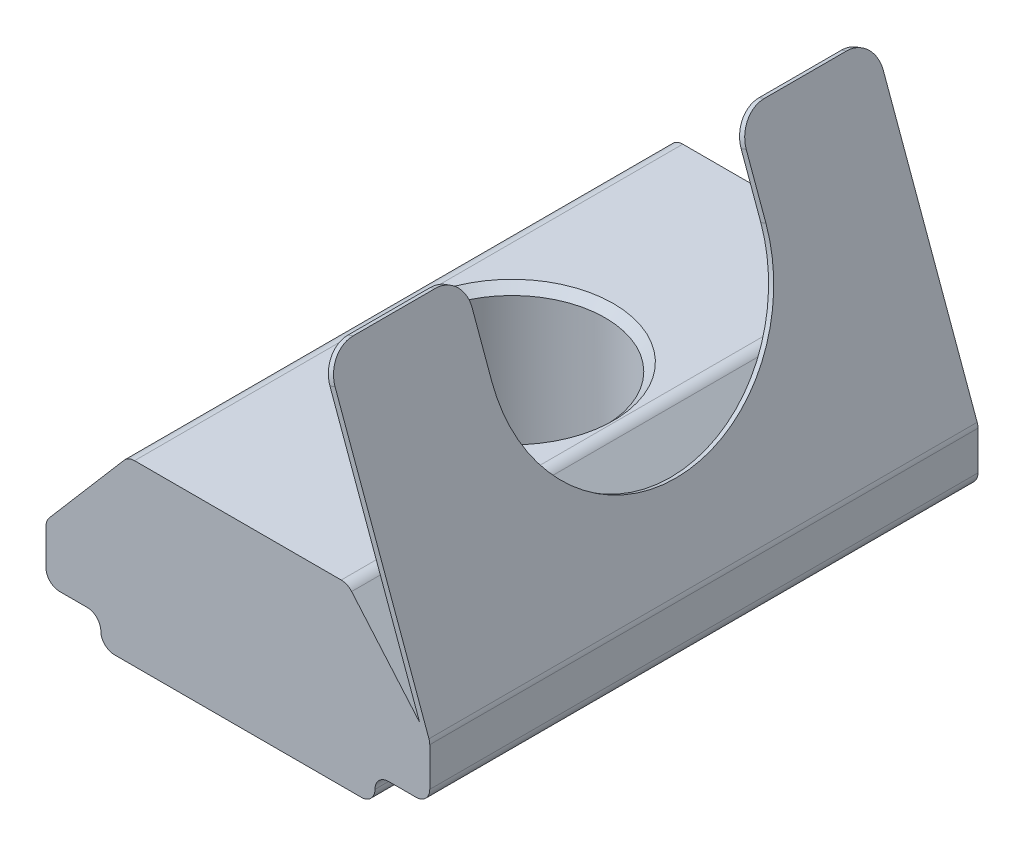
ISO-10303-21;
HEADER;
FILE_DESCRIPTION(('STEP AP214'),'2;1');
FILE_NAME('part.step','',(''),(''),'','','');
FILE_SCHEMA(('AUTOMOTIVE_DESIGN { 1 0 10303 214 1 1 1 1 }'));
ENDSEC;
DATA;
#1=APPLICATION_CONTEXT('core data for automotive mechanical design processes');
#2=APPLICATION_PROTOCOL_DEFINITION('international standard','automotive_design',2000,#1);
#3=PRODUCT_CONTEXT('',#1,'mechanical');
#4=PRODUCT('Part','Part','',(#3));
#5=PRODUCT_RELATED_PRODUCT_CATEGORY('part','',(#4));
#6=PRODUCT_DEFINITION_FORMATION('','',#4);
#7=PRODUCT_DEFINITION_CONTEXT('part definition',#1,'design');
#8=PRODUCT_DEFINITION('design','',#6,#7);
#9=PRODUCT_DEFINITION_SHAPE('','',#8);
#10=(LENGTH_UNIT() NAMED_UNIT(*) SI_UNIT(.MILLI.,.METRE.));
#11=(NAMED_UNIT(*) PLANE_ANGLE_UNIT() SI_UNIT($,.RADIAN.));
#12=(NAMED_UNIT(*) SI_UNIT($,.STERADIAN.) SOLID_ANGLE_UNIT());
#13=UNCERTAINTY_MEASURE_WITH_UNIT(LENGTH_MEASURE(1.E-05),#10,'distance_accuracy_value','');
#14=(GEOMETRIC_REPRESENTATION_CONTEXT(3) GLOBAL_UNCERTAINTY_ASSIGNED_CONTEXT((#13)) GLOBAL_UNIT_ASSIGNED_CONTEXT((#10,
#11,#12)) REPRESENTATION_CONTEXT('',''));
#15=CARTESIAN_POINT('',(0.,0.,0.));
#16=DIRECTION('',(0.,0.,1.));
#17=DIRECTION('',(1.,0.,0.));
#18=AXIS2_PLACEMENT_3D('',#15,#16,#17);
#19=CARTESIAN_POINT('',(1.8519080564447,9.18497845719706,8.88238530098761));
#20=DIRECTION('',(0.342020143325663,-0.93969262078591,0.));
#21=DIRECTION('',(0.93969262078591,0.342020143325663,0.));
#22=AXIS2_PLACEMENT_3D('',#19,#20,#21);
#23=PLANE('',#22);
#24=DIRECTION('',(0.,0.,-1.));
#25=VECTOR('',#24,1.);
#26=CARTESIAN_POINT('',(1.8519080564447,9.18497845719706,8.88238530098761));
#27=LINE('',#26,#25);
#28=CARTESIAN_POINT('',(1.8519080564447,9.18497845719706,-7.11761469901239));
#29=VERTEX_POINT('',#28);
#30=CARTESIAN_POINT('',(1.8519080564447,9.18497845719706,-10.1176146990124));
#31=VERTEX_POINT('',#30);
#32=EDGE_CURVE('E258',#29,#31,#27,.T.);
#33=ORIENTED_EDGE('',*,*,#32,.T.);
#34=DIRECTION('',(-0.93969262078591,-0.342020143325663,0.));
#35=VECTOR('',#34,1.);
#36=CARTESIAN_POINT('',(1.8519080564447,9.18497845719706,-10.1176146990124));
#37=LINE('',#36,#35);
#38=CARTESIAN_POINT('',(1.66396953228751,9.11657442853193,-10.1176146990124));
#39=VERTEX_POINT('',#38);
#40=EDGE_CURVE('E412',#31,#39,#37,.T.);
#41=ORIENTED_EDGE('',*,*,#40,.T.);
#42=DIRECTION('',(0.,0.,-1.));
#43=VECTOR('',#42,1.);
#44=CARTESIAN_POINT('',(1.66396953228751,9.11657442853193,8.88238530098761));
#45=LINE('',#44,#43);
#46=CARTESIAN_POINT('',(1.66396953228751,9.11657442853193,-7.11761469901239));
#47=VERTEX_POINT('',#46);
#48=EDGE_CURVE('E254',#47,#39,#45,.T.);
#49=ORIENTED_EDGE('',*,*,#48,.F.);
#50=DIRECTION('',(0.93969262078591,0.342020143325663,0.));
#51=VECTOR('',#50,1.);
#52=CARTESIAN_POINT('',(1.8519080564447,9.18497845719706,-7.11761469901239));
#53=LINE('',#52,#51);
#54=EDGE_CURVE('E409',#47,#29,#53,.T.);
#55=ORIENTED_EDGE('',*,*,#54,.T.);
#56=EDGE_LOOP('',(#33,#41,#49,#55));
#57=FACE_BOUND('',#56,.T.);
#58=ADVANCED_FACE('F16',(#57),#23,.F.);
#59=CARTESIAN_POINT('',(-6.35166835264044,-4.24560963352654,8.88238530098761));
#60=DIRECTION('',(0.,1.,0.));
#61=DIRECTION('',(0.,0.,1.));
#62=AXIS2_PLACEMENT_3D('',#59,#60,#61);
#63=PLANE('',#62);
#64=CARTESIAN_POINT('',(-1.35166835264044,-4.24560963352654,-1.11761469901239));
#65=DIRECTION('',(0.,1.,0.));
#66=DIRECTION('',(0.,0.,1.));
#67=AXIS2_PLACEMENT_3D('',#64,#65,#66);
#68=CIRCLE('',#67,4.4);
#69=CARTESIAN_POINT('',(-1.35166835264044,-4.24560963352654,3.28238530098761));
#70=VERTEX_POINT('',#69);
#71=EDGE_CURVE('E383',#70,#70,#68,.T.);
#72=ORIENTED_EDGE('',*,*,#71,.T.);
#73=EDGE_LOOP('',(#72));
#74=FACE_BOUND('',#73,.T.);
#75=DIRECTION('',(1.,0.,0.));
#76=VECTOR('',#75,1.);
#77=CARTESIAN_POINT('',(-6.35166835264044,-4.24560963352654,8.88238530098761));
#78=LINE('',#77,#76);
#79=CARTESIAN_POINT('',(-5.85166835264045,-4.24560963352654,8.88238530098761));
#80=VERTEX_POINT('',#79);
#81=CARTESIAN_POINT('',(3.14833164735956,-4.24560963352654,8.88238530098761));
#82=VERTEX_POINT('',#81);
#83=EDGE_CURVE('E262',#80,#82,#78,.T.);
#84=ORIENTED_EDGE('',*,*,#83,.F.);
#85=DIRECTION('',(0.,0.,-1.));
#86=VECTOR('',#85,1.);
#87=CARTESIAN_POINT('',(-5.85166835264045,-4.24560963352654,8.88238530098761));
#88=LINE('',#87,#86);
#89=CARTESIAN_POINT('',(-5.85166835264045,-4.24560963352654,-11.1176146990124));
#90=VERTEX_POINT('',#89);
#91=EDGE_CURVE('E351',#80,#90,#88,.T.);
#92=ORIENTED_EDGE('',*,*,#91,.T.);
#93=DIRECTION('',(1.,0.,0.));
#94=VECTOR('',#93,1.);
#95=CARTESIAN_POINT('',(-6.35166835264044,-4.24560963352654,-11.1176146990124));
#96=LINE('',#95,#94);
#97=CARTESIAN_POINT('',(3.14833164735956,-4.24560963352654,-11.1176146990124));
#98=VERTEX_POINT('',#97);
#99=EDGE_CURVE('E261',#90,#98,#96,.T.);
#100=ORIENTED_EDGE('',*,*,#99,.T.);
#101=DIRECTION('',(0.,0.,-1.));
#102=VECTOR('',#101,1.);
#103=CARTESIAN_POINT('',(3.14833164735956,-4.24560963352654,8.88238530098761));
#104=LINE('',#103,#102);
#105=EDGE_CURVE('E349',#98,#82,#104,.F.);
#106=ORIENTED_EDGE('',*,*,#105,.T.);
#107=EDGE_LOOP('',(#84,#92,#100,#106));
#108=FACE_BOUND('',#107,.T.);
#109=ADVANCED_FACE('F505',(#74,#108),#63,.F.);
#110=CARTESIAN_POINT('',(3.64833164735956,-3.24560963352654,8.88238530098761));
#111=DIRECTION('',(0.,1.,0.));
#112=DIRECTION('',(0.,0.,1.));
#113=AXIS2_PLACEMENT_3D('',#110,#111,#112);
#114=PLANE('',#113);
#115=DIRECTION('',(1.,0.,0.));
#116=VECTOR('',#115,1.);
#117=CARTESIAN_POINT('',(3.64833164735956,-3.24560963352654,8.88238530098761));
#118=LINE('',#117,#116);
#119=CARTESIAN_POINT('',(4.14833164735956,-3.24560963352654,8.88238530098761));
#120=VERTEX_POINT('',#119);
#121=CARTESIAN_POINT('',(5.14833164735956,-3.24560963352654,8.88238530098761));
#122=VERTEX_POINT('',#121);
#123=EDGE_CURVE('E265',#120,#122,#118,.T.);
#124=ORIENTED_EDGE('',*,*,#123,.F.);
#125=DIRECTION('',(0.,0.,-1.));
#126=VECTOR('',#125,1.);
#127=CARTESIAN_POINT('',(4.14833164735956,-3.24560963352654,-11.1176146990124));
#128=LINE('',#127,#126);
#129=CARTESIAN_POINT('',(4.14833164735956,-3.24560963352654,-11.1176146990124));
#130=VERTEX_POINT('',#129);
#131=EDGE_CURVE('E389',#120,#130,#128,.T.);
#132=ORIENTED_EDGE('',*,*,#131,.T.);
#133=DIRECTION('',(1.,0.,0.));
#134=VECTOR('',#133,1.);
#135=CARTESIAN_POINT('',(3.64833164735956,-3.24560963352654,-11.1176146990124));
#136=LINE('',#135,#134);
#137=CARTESIAN_POINT('',(5.14833164735956,-3.24560963352654,-11.1176146990124));
#138=VERTEX_POINT('',#137);
#139=EDGE_CURVE('E289',#130,#138,#136,.T.);
#140=ORIENTED_EDGE('',*,*,#139,.T.);
#141=DIRECTION('',(0.,0.,-1.));
#142=VECTOR('',#141,1.);
#143=CARTESIAN_POINT('',(5.14833164735956,-3.24560963352654,8.88238530098761));
#144=LINE('',#143,#142);
#145=EDGE_CURVE('E377',#138,#122,#144,.F.);
#146=ORIENTED_EDGE('',*,*,#145,.T.);
#147=EDGE_LOOP('',(#124,#132,#140,#146));
#148=FACE_BOUND('',#147,.T.);
#149=ADVANCED_FACE('F517',(#148),#114,.F.);
#150=CARTESIAN_POINT('',(5.64833164735956,-3.24560963352654,8.88238530098761));
#151=DIRECTION('',(-1.,0.,0.));
#152=DIRECTION('',(0.,0.,1.));
#153=AXIS2_PLACEMENT_3D('',#150,#151,#152);
#154=PLANE('',#153);
#155=DIRECTION('',(0.,1.,0.));
#156=VECTOR('',#155,1.);
#157=CARTESIAN_POINT('',(5.64833164735956,-3.24560963352654,-11.1176146990124));
#158=LINE('',#157,#156);
#159=CARTESIAN_POINT('',(5.64833164735956,-2.74560963352654,-11.1176146990124));
#160=VERTEX_POINT('',#159);
#161=CARTESIAN_POINT('',(5.64833164735956,-1.33377312388078,-11.1176146990124));
#162=VERTEX_POINT('',#161);
#163=EDGE_CURVE('E291',#160,#162,#158,.T.);
#164=ORIENTED_EDGE('',*,*,#163,.T.);
#165=DIRECTION('',(0.,0.,-1.));
#166=VECTOR('',#165,1.);
#167=CARTESIAN_POINT('',(5.64833164735956,-1.33377312388078,8.88238530098761));
#168=LINE('',#167,#166);
#169=CARTESIAN_POINT('',(5.64833164735956,-1.33377312388078,8.88238530098761));
#170=VERTEX_POINT('',#169);
#171=EDGE_CURVE('E331',#162,#170,#168,.F.);
#172=ORIENTED_EDGE('',*,*,#171,.T.);
#173=DIRECTION('',(0.,1.,0.));
#174=VECTOR('',#173,1.);
#175=CARTESIAN_POINT('',(5.64833164735956,-3.24560963352654,8.88238530098761));
#176=LINE('',#175,#174);
#177=CARTESIAN_POINT('',(5.64833164735956,-2.74560963352654,8.88238530098761));
#178=VERTEX_POINT('',#177);
#179=EDGE_CURVE('E268',#178,#170,#176,.T.);
#180=ORIENTED_EDGE('',*,*,#179,.F.);
#181=DIRECTION('',(0.,0.,-1.));
#182=VECTOR('',#181,1.);
#183=CARTESIAN_POINT('',(5.64833164735956,-2.74560963352654,8.88238530098761));
#184=LINE('',#183,#182);
#185=EDGE_CURVE('E328',#178,#160,#184,.T.);
#186=ORIENTED_EDGE('',*,*,#185,.T.);
#187=EDGE_LOOP('',(#164,#172,#180,#186));
#188=FACE_BOUND('',#187,.T.);
#189=ADVANCED_FACE('F529',(#188),#154,.F.);
#190=CARTESIAN_POINT('',(5.64833164735956,-1.24560963352654,8.88238530098761));
#191=DIRECTION('',(-0.759256602365296,-0.650791373455969,0.));
#192=DIRECTION('',(0.650791373455969,-0.759256602365296,0.));
#193=AXIS2_PLACEMENT_3D('',#190,#191,#192);
#194=PLANE('',#193);
#195=DIRECTION('',(-0.650791373455969,0.759256602365296,0.));
#196=VECTOR('',#195,1.);
#197=CARTESIAN_POINT('',(5.64833164735956,-1.24560963352654,-11.1176146990124));
#198=LINE('',#197,#196);
#199=CARTESIAN_POINT('',(5.27841963923252,-0.814045624045001,-11.1176146990124));
#200=VERTEX_POINT('',#199);
#201=CARTESIAN_POINT('',(2.797992487307,2.07978605320144,-11.1176146990124));
#202=VERTEX_POINT('',#201);
#203=EDGE_CURVE('E294',#200,#202,#198,.T.);
#204=ORIENTED_EDGE('',*,*,#203,.T.);
#205=DIRECTION('',(0.,0.,-1.));
#206=VECTOR('',#205,1.);
#207=CARTESIAN_POINT('',(2.797992487307,2.07978605320144,8.88238530098761));
#208=LINE('',#207,#206);
#209=CARTESIAN_POINT('',(2.797992487307,2.07978605320144,8.88238530098761));
#210=VERTEX_POINT('',#209);
#211=EDGE_CURVE('E375',#202,#210,#208,.F.);
#212=ORIENTED_EDGE('',*,*,#211,.T.);
#213=DIRECTION('',(-0.650791373455969,0.759256602365296,0.));
#214=VECTOR('',#213,1.);
#215=CARTESIAN_POINT('',(5.64833164735956,-1.24560963352654,8.88238530098761));
#216=LINE('',#215,#214);
#217=CARTESIAN_POINT('',(5.27841963923252,-0.814045624045001,8.88238530098761));
#218=VERTEX_POINT('',#217);
#219=EDGE_CURVE('E271',#218,#210,#216,.T.);
#220=ORIENTED_EDGE('',*,*,#219,.F.);
#221=DIRECTION('',(0.,0.,-1.));
#222=VECTOR('',#221,1.);
#223=CARTESIAN_POINT('',(5.27841963923252,-0.814045624045001,8.88238530098761));
#224=LINE('',#223,#222);
#225=EDGE_CURVE('E248',#218,#200,#224,.T.);
#226=ORIENTED_EDGE('',*,*,#225,.T.);
#227=EDGE_LOOP('',(#204,#212,#220,#226));
#228=FACE_BOUND('',#227,.T.);
#229=ADVANCED_FACE('F454',(#228),#194,.F.);
#230=CARTESIAN_POINT('',(2.64833164735956,2.25439036647346,8.88238530098761));
#231=DIRECTION('',(0.,-1.,0.));
#232=DIRECTION('',(0.,0.,-1.));
#233=AXIS2_PLACEMENT_3D('',#230,#231,#232);
#234=PLANE('',#233);
#235=CARTESIAN_POINT('',(-1.35166835264044,2.25439036647346,-1.11761469901239));
#236=DIRECTION('',(0.,-1.,0.));
#237=DIRECTION('',(0.,0.,-1.));
#238=AXIS2_PLACEMENT_3D('',#235,#236,#237);
#239=CIRCLE('',#238,3.7);
#240=CARTESIAN_POINT('',(-1.35166835264044,2.25439036647346,-4.81761469901239));
#241=VERTEX_POINT('',#240);
#242=EDGE_CURVE('E405',#241,#241,#239,.T.);
#243=ORIENTED_EDGE('',*,*,#242,.T.);
#244=EDGE_LOOP('',(#243));
#245=FACE_BOUND('',#244,.T.);
#246=DIRECTION('',(-1.,0.,0.));
#247=VECTOR('',#246,1.);
#248=CARTESIAN_POINT('',(2.64833164735956,2.25439036647346,-11.1176146990124));
#249=LINE('',#248,#247);
#250=CARTESIAN_POINT('',(2.41836418612435,2.25439036647346,-11.1176146990124));
#251=VERTEX_POINT('',#250);
#252=CARTESIAN_POINT('',(-5.12170089140524,2.25439036647346,-11.1176146990124));
#253=VERTEX_POINT('',#252);
#254=EDGE_CURVE('E297',#251,#253,#249,.T.);
#255=ORIENTED_EDGE('',*,*,#254,.T.);
#256=DIRECTION('',(0.,0.,-1.));
#257=VECTOR('',#256,1.);
#258=CARTESIAN_POINT('',(-5.12170089140524,2.25439036647346,8.88238530098761));
#259=LINE('',#258,#257);
#260=CARTESIAN_POINT('',(-5.12170089140524,2.25439036647346,8.88238530098761));
#261=VERTEX_POINT('',#260);
#262=EDGE_CURVE('E373',#253,#261,#259,.F.);
#263=ORIENTED_EDGE('',*,*,#262,.T.);
#264=DIRECTION('',(-1.,0.,0.));
#265=VECTOR('',#264,1.);
#266=CARTESIAN_POINT('',(2.64833164735956,2.25439036647346,8.88238530098761));
#267=LINE('',#266,#265);
#268=CARTESIAN_POINT('',(2.41836418612435,2.25439036647346,8.88238530098761));
#269=VERTEX_POINT('',#268);
#270=EDGE_CURVE('E274',#269,#261,#267,.T.);
#271=ORIENTED_EDGE('',*,*,#270,.F.);
#272=DIRECTION('',(0.,0.,-1.));
#273=VECTOR('',#272,1.);
#274=CARTESIAN_POINT('',(2.41836418612435,2.25439036647346,8.88238530098761));
#275=LINE('',#274,#273);
#276=EDGE_CURVE('E370',#269,#251,#275,.T.);
#277=ORIENTED_EDGE('',*,*,#276,.T.);
#278=EDGE_LOOP('',(#255,#263,#271,#277));
#279=FACE_BOUND('',#278,.T.);
#280=ADVANCED_FACE('F463',(#245,#279),#234,.F.);
#281=CARTESIAN_POINT('',(-8.35166835264044,-1.24560963352654,8.88238530098761));
#282=DIRECTION('',(0.759256602365296,-0.650791373455969,0.));
#283=DIRECTION('',(0.650791373455969,0.759256602365296,0.));
#284=AXIS2_PLACEMENT_3D('',#281,#282,#283);
#285=PLANE('',#284);
#286=DIRECTION('',(-0.650791373455969,-0.759256602365296,0.));
#287=VECTOR('',#286,1.);
#288=CARTESIAN_POINT('',(-8.35166835264044,-1.24560963352654,-11.1176146990124));
#289=LINE('',#288,#287);
#290=CARTESIAN_POINT('',(-5.50132919258789,2.07978605320144,-11.1176146990124));
#291=VERTEX_POINT('',#290);
#292=CARTESIAN_POINT('',(-8.23129665382309,-1.1051759849063,-11.1176146990124));
#293=VERTEX_POINT('',#292);
#294=EDGE_CURVE('E300',#291,#293,#289,.T.);
#295=ORIENTED_EDGE('',*,*,#294,.T.);
#296=DIRECTION('',(0.,0.,-1.));
#297=VECTOR('',#296,1.);
#298=CARTESIAN_POINT('',(-8.23129665382309,-1.1051759849063,8.88238530098761));
#299=LINE('',#298,#297);
#300=CARTESIAN_POINT('',(-8.23129665382309,-1.1051759849063,8.88238530098761));
#301=VERTEX_POINT('',#300);
#302=EDGE_CURVE('E368',#293,#301,#299,.F.);
#303=ORIENTED_EDGE('',*,*,#302,.T.);
#304=DIRECTION('',(-0.650791373455969,-0.759256602365296,0.));
#305=VECTOR('',#304,1.);
#306=CARTESIAN_POINT('',(-8.35166835264044,-1.24560963352654,8.88238530098761));
#307=LINE('',#306,#305);
#308=CARTESIAN_POINT('',(-5.50132919258789,2.07978605320144,8.88238530098761));
#309=VERTEX_POINT('',#308);
#310=EDGE_CURVE('E277',#309,#301,#307,.T.);
#311=ORIENTED_EDGE('',*,*,#310,.F.);
#312=DIRECTION('',(0.,0.,-1.));
#313=VECTOR('',#312,1.);
#314=CARTESIAN_POINT('',(-5.50132919258789,2.07978605320144,8.88238530098761));
#315=LINE('',#314,#313);
#316=EDGE_CURVE('E365',#309,#291,#315,.T.);
#317=ORIENTED_EDGE('',*,*,#316,.T.);
#318=EDGE_LOOP('',(#295,#303,#311,#317));
#319=FACE_BOUND('',#318,.T.);
#320=ADVANCED_FACE('F474',(#319),#285,.F.);
#321=CARTESIAN_POINT('',(-8.35166835264044,-3.24560963352654,8.88238530098761));
#322=DIRECTION('',(1.,0.,0.));
#323=DIRECTION('',(0.,0.,-1.));
#324=AXIS2_PLACEMENT_3D('',#321,#322,#323);
#325=PLANE('',#324);
#326=DIRECTION('',(0.,-1.,0.));
#327=VECTOR('',#326,1.);
#328=CARTESIAN_POINT('',(-8.35166835264044,-3.24560963352654,-11.1176146990124));
#329=LINE('',#328,#327);
#330=CARTESIAN_POINT('',(-8.35166835264044,-1.43057167163428,-11.1176146990124));
#331=VERTEX_POINT('',#330);
#332=CARTESIAN_POINT('',(-8.35166835264044,-2.74560963352654,-11.1176146990124));
#333=VERTEX_POINT('',#332);
#334=EDGE_CURVE('E303',#331,#333,#329,.T.);
#335=ORIENTED_EDGE('',*,*,#334,.T.);
#336=DIRECTION('',(0.,0.,-1.));
#337=VECTOR('',#336,1.);
#338=CARTESIAN_POINT('',(-8.35166835264044,-2.74560963352654,8.88238530098761));
#339=LINE('',#338,#337);
#340=CARTESIAN_POINT('',(-8.35166835264044,-2.74560963352654,8.88238530098761));
#341=VERTEX_POINT('',#340);
#342=EDGE_CURVE('E363',#333,#341,#339,.F.);
#343=ORIENTED_EDGE('',*,*,#342,.T.);
#344=DIRECTION('',(0.,-1.,0.));
#345=VECTOR('',#344,1.);
#346=CARTESIAN_POINT('',(-8.35166835264044,-3.24560963352654,8.88238530098761));
#347=LINE('',#346,#345);
#348=CARTESIAN_POINT('',(-8.35166835264044,-1.43057167163428,8.88238530098761));
#349=VERTEX_POINT('',#348);
#350=EDGE_CURVE('E280',#349,#341,#347,.T.);
#351=ORIENTED_EDGE('',*,*,#350,.F.);
#352=DIRECTION('',(0.,0.,-1.));
#353=VECTOR('',#352,1.);
#354=CARTESIAN_POINT('',(-8.35166835264044,-1.43057167163428,8.88238530098761));
#355=LINE('',#354,#353);
#356=EDGE_CURVE('E360',#349,#331,#355,.T.);
#357=ORIENTED_EDGE('',*,*,#356,.T.);
#358=EDGE_LOOP('',(#335,#343,#351,#357));
#359=FACE_BOUND('',#358,.T.);
#360=ADVANCED_FACE('F483',(#359),#325,.F.);
#361=CARTESIAN_POINT('',(-8.35166835264044,-3.24560963352654,8.88238530098761));
#362=DIRECTION('',(0.,1.,0.));
#363=DIRECTION('',(0.,0.,1.));
#364=AXIS2_PLACEMENT_3D('',#361,#362,#363);
#365=PLANE('',#364);
#366=DIRECTION('',(1.,0.,0.));
#367=VECTOR('',#366,1.);
#368=CARTESIAN_POINT('',(-8.35166835264044,-3.24560963352654,-11.1176146990124));
#369=LINE('',#368,#367);
#370=CARTESIAN_POINT('',(-7.85166835264045,-3.24560963352654,-11.1176146990124));
#371=VERTEX_POINT('',#370);
#372=CARTESIAN_POINT('',(-6.85166835264044,-3.24560963352654,-11.1176146990124));
#373=VERTEX_POINT('',#372);
#374=EDGE_CURVE('E266',#371,#373,#369,.T.);
#375=ORIENTED_EDGE('',*,*,#374,.T.);
#376=DIRECTION('',(0.,0.,-1.));
#377=VECTOR('',#376,1.);
#378=CARTESIAN_POINT('',(-6.85166835264044,-3.24560963352654,8.88238530098761));
#379=LINE('',#378,#377);
#380=CARTESIAN_POINT('',(-6.85166835264044,-3.24560963352654,8.88238530098761));
#381=VERTEX_POINT('',#380);
#382=EDGE_CURVE('E392',#373,#381,#379,.F.);
#383=ORIENTED_EDGE('',*,*,#382,.T.);
#384=DIRECTION('',(1.,0.,0.));
#385=VECTOR('',#384,1.);
#386=CARTESIAN_POINT('',(-8.35166835264044,-3.24560963352654,8.88238530098761));
#387=LINE('',#386,#385);
#388=CARTESIAN_POINT('',(-7.85166835264045,-3.24560963352654,8.88238530098761));
#389=VERTEX_POINT('',#388);
#390=EDGE_CURVE('E283',#389,#381,#387,.T.);
#391=ORIENTED_EDGE('',*,*,#390,.F.);
#392=DIRECTION('',(0.,0.,-1.));
#393=VECTOR('',#392,1.);
#394=CARTESIAN_POINT('',(-7.85166835264045,-3.24560963352654,8.88238530098761));
#395=LINE('',#394,#393);
#396=EDGE_CURVE('E357',#389,#371,#395,.T.);
#397=ORIENTED_EDGE('',*,*,#396,.T.);
#398=EDGE_LOOP('',(#375,#383,#391,#397));
#399=FACE_BOUND('',#398,.T.);
#400=ADVANCED_FACE('F492',(#399),#365,.F.);
#401=CARTESIAN_POINT('',(-1.35166835264044,-4.24560963352654,8.88238530098761));
#402=DIRECTION('',(0.,0.,1.));
#403=DIRECTION('',(1.,0.,0.));
#404=AXIS2_PLACEMENT_3D('',#401,#402,#403);
#405=PLANE('',#404);
#406=DIRECTION('',(-0.342020143325663,0.939692620785911,0.));
#407=VECTOR('',#406,1.);
#408=CARTESIAN_POINT('',(5.64833164735956,-1.24560963352654,8.88238530098761));
#409=LINE('',#408,#407);
#410=CARTESIAN_POINT('',(5.61817795775251,-1.16276305221794,8.88238530098761));
#411=VERTEX_POINT('',#410);
#412=CARTESIAN_POINT('',(2.19392819977036,8.24528583641115,8.88238530098761));
#413=VERTEX_POINT('',#412);
#414=EDGE_CURVE('E243',#411,#413,#409,.T.);
#415=ORIENTED_EDGE('',*,*,#414,.T.);
#416=DIRECTION('',(-0.93969262078591,-0.342020143325663,0.));
#417=VECTOR('',#416,1.);
#418=CARTESIAN_POINT('',(2.00598967561318,8.17688180774602,8.88238530098761));
#419=LINE('',#418,#417);
#420=CARTESIAN_POINT('',(2.00598967561318,8.17688180774602,8.88238530098761));
#421=VERTEX_POINT('',#420);
#422=EDGE_CURVE('E432',#413,#421,#419,.T.);
#423=ORIENTED_EDGE('',*,*,#422,.T.);
#424=DIRECTION('',(0.342020143325663,-0.939692620785911,0.));
#425=VECTOR('',#424,1.);
#426=CARTESIAN_POINT('',(1.66396953228751,9.11657442853193,8.88238530098761));
#427=LINE('',#426,#425);
#428=EDGE_CURVE('E245',#421,#218,#427,.T.);
#429=ORIENTED_EDGE('',*,*,#428,.T.);
#430=ORIENTED_EDGE('',*,*,#219,.T.);
#431=CARTESIAN_POINT('',(2.41836418612435,1.75439036647346,8.88238530098761));
#432=DIRECTION('',(0.,0.,1.));
#433=DIRECTION('',(1.,0.,0.));
#434=AXIS2_PLACEMENT_3D('',#431,#432,#433);
#435=CIRCLE('',#434,0.5);
#436=EDGE_CURVE('E337',#210,#269,#435,.T.);
#437=ORIENTED_EDGE('',*,*,#436,.T.);
#438=ORIENTED_EDGE('',*,*,#270,.T.);
#439=CARTESIAN_POINT('',(-5.12170089140524,1.75439036647346,8.88238530098761));
#440=DIRECTION('',(0.,0.,1.));
#441=DIRECTION('',(1.,0.,0.));
#442=AXIS2_PLACEMENT_3D('',#439,#440,#441);
#443=CIRCLE('',#442,0.5);
#444=EDGE_CURVE('E339',#261,#309,#443,.T.);
#445=ORIENTED_EDGE('',*,*,#444,.T.);
#446=ORIENTED_EDGE('',*,*,#310,.T.);
#447=CARTESIAN_POINT('',(-7.85166835264045,-1.43057167163428,8.88238530098761));
#448=DIRECTION('',(0.,0.,1.));
#449=DIRECTION('',(1.,0.,0.));
#450=AXIS2_PLACEMENT_3D('',#447,#448,#449);
#451=CIRCLE('',#450,0.5);
#452=EDGE_CURVE('E341',#301,#349,#451,.T.);
#453=ORIENTED_EDGE('',*,*,#452,.T.);
#454=ORIENTED_EDGE('',*,*,#350,.T.);
#455=CARTESIAN_POINT('',(-7.85166835264045,-2.74560963352654,8.88238530098761));
#456=DIRECTION('',(0.,0.,1.));
#457=DIRECTION('',(1.,0.,0.));
#458=AXIS2_PLACEMENT_3D('',#455,#456,#457);
#459=CIRCLE('',#458,0.5);
#460=EDGE_CURVE('E343',#341,#389,#459,.T.);
#461=ORIENTED_EDGE('',*,*,#460,.T.);
#462=ORIENTED_EDGE('',*,*,#390,.T.);
#463=CARTESIAN_POINT('',(-6.85166835264044,-3.74560963352654,8.88238530098761));
#464=DIRECTION('',(0.,0.,1.));
#465=DIRECTION('',(1.,0.,0.));
#466=AXIS2_PLACEMENT_3D('',#463,#464,#465);
#467=CIRCLE('',#466,0.5);
#468=CARTESIAN_POINT('',(-6.35166835264044,-3.74560963352654,8.88238530098761));
#469=VERTEX_POINT('',#468);
#470=EDGE_CURVE('E400',#381,#469,#467,.F.);
#471=ORIENTED_EDGE('',*,*,#470,.T.);
#472=CARTESIAN_POINT('',(-5.85166835264045,-3.74560963352654,8.88238530098761));
#473=DIRECTION('',(0.,0.,1.));
#474=DIRECTION('',(1.,0.,0.));
#475=AXIS2_PLACEMENT_3D('',#472,#473,#474);
#476=CIRCLE('',#475,0.5);
#477=EDGE_CURVE('E345',#469,#80,#476,.T.);
#478=ORIENTED_EDGE('',*,*,#477,.T.);
#479=ORIENTED_EDGE('',*,*,#83,.T.);
#480=CARTESIAN_POINT('',(3.14833164735956,-3.74560963352654,8.88238530098761));
#481=DIRECTION('',(0.,0.,1.));
#482=DIRECTION('',(1.,0.,0.));
#483=AXIS2_PLACEMENT_3D('',#480,#481,#482);
#484=CIRCLE('',#483,0.5);
#485=CARTESIAN_POINT('',(3.64833164735956,-3.74560963352654,8.88238530098761));
#486=VERTEX_POINT('',#485);
#487=EDGE_CURVE('E333',#82,#486,#484,.T.);
#488=ORIENTED_EDGE('',*,*,#487,.T.);
#489=CARTESIAN_POINT('',(4.14833164735956,-3.74560963352654,8.88238530098761));
#490=DIRECTION('',(0.,0.,1.));
#491=DIRECTION('',(1.,0.,0.));
#492=AXIS2_PLACEMENT_3D('',#489,#490,#491);
#493=CIRCLE('',#492,0.5);
#494=EDGE_CURVE('E396',#486,#120,#493,.F.);
#495=ORIENTED_EDGE('',*,*,#494,.T.);
#496=ORIENTED_EDGE('',*,*,#123,.T.);
#497=CARTESIAN_POINT('',(5.14833164735956,-2.74560963352654,8.88238530098761));
#498=DIRECTION('',(0.,0.,1.));
#499=DIRECTION('',(1.,0.,0.));
#500=AXIS2_PLACEMENT_3D('',#497,#498,#499);
#501=CIRCLE('',#500,0.5);
#502=EDGE_CURVE('E335',#122,#178,#501,.T.);
#503=ORIENTED_EDGE('',*,*,#502,.T.);
#504=ORIENTED_EDGE('',*,*,#179,.T.);
#505=CARTESIAN_POINT('',(5.14833164735956,-1.33377312388078,8.88238530098761));
#506=DIRECTION('',(0.,0.,1.));
#507=DIRECTION('',(1.,0.,0.));
#508=AXIS2_PLACEMENT_3D('',#505,#506,#507);
#509=CIRCLE('',#508,0.5);
#510=EDGE_CURVE('E347',#170,#411,#509,.T.);
#511=ORIENTED_EDGE('',*,*,#510,.T.);
#512=EDGE_LOOP('',(#415,#423,#429,#430,#437,#438,#445,#446,#453,#454,#461,#462,#471,#478,#479,
#488,#495,#496,#503,#504,#511));
#513=FACE_BOUND('',#512,.T.);
#514=ADVANCED_FACE('F448',(#513),#405,.T.);
#515=CARTESIAN_POINT('',(-1.35166835264044,-4.24560963352654,-11.1176146990124));
#516=DIRECTION('',(0.,0.,1.));
#517=DIRECTION('',(1.,0.,0.));
#518=AXIS2_PLACEMENT_3D('',#515,#516,#517);
#519=PLANE('',#518);
#520=DIRECTION('',(0.342020143325663,-0.939692620785911,0.));
#521=VECTOR('',#520,1.);
#522=CARTESIAN_POINT('',(1.66396953228751,9.11657442853193,-11.1176146990124));
#523=LINE('',#522,#521);
#524=CARTESIAN_POINT('',(2.00598967561318,8.17688180774602,-11.1176146990124));
#525=VERTEX_POINT('',#524);
#526=EDGE_CURVE('E246',#525,#200,#523,.T.);
#527=ORIENTED_EDGE('',*,*,#526,.F.);
#528=DIRECTION('',(-0.93969262078591,-0.342020143325663,0.));
#529=VECTOR('',#528,1.);
#530=CARTESIAN_POINT('',(-4.95140876567589,5.64459586718677,-11.1176146990124));
#531=LINE('',#530,#529);
#532=CARTESIAN_POINT('',(2.19392819977036,8.24528583641115,-11.1176146990124));
#533=VERTEX_POINT('',#532);
#534=EDGE_CURVE('E423',#525,#533,#531,.F.);
#535=ORIENTED_EDGE('',*,*,#534,.T.);
#536=DIRECTION('',(-0.342020143325663,0.939692620785911,0.));
#537=VECTOR('',#536,1.);
#538=CARTESIAN_POINT('',(5.64833164735956,-1.24560963352654,-11.1176146990124));
#539=LINE('',#538,#537);
#540=CARTESIAN_POINT('',(5.61817795775251,-1.16276305221794,-11.1176146990124));
#541=VERTEX_POINT('',#540);
#542=EDGE_CURVE('E220',#541,#533,#539,.T.);
#543=ORIENTED_EDGE('',*,*,#542,.F.);
#544=CARTESIAN_POINT('',(5.14833164735956,-1.33377312388078,-11.1176146990124));
#545=DIRECTION('',(0.,0.,1.));
#546=DIRECTION('',(1.,0.,0.));
#547=AXIS2_PLACEMENT_3D('',#544,#545,#546);
#548=CIRCLE('',#547,0.5);
#549=EDGE_CURVE('E326',#541,#162,#548,.F.);
#550=ORIENTED_EDGE('',*,*,#549,.T.);
#551=ORIENTED_EDGE('',*,*,#163,.F.);
#552=CARTESIAN_POINT('',(5.14833164735956,-2.74560963352654,-11.1176146990124));
#553=DIRECTION('',(0.,0.,1.));
#554=DIRECTION('',(1.,0.,0.));
#555=AXIS2_PLACEMENT_3D('',#552,#553,#554);
#556=CIRCLE('',#555,0.5);
#557=EDGE_CURVE('E312',#160,#138,#556,.F.);
#558=ORIENTED_EDGE('',*,*,#557,.T.);
#559=ORIENTED_EDGE('',*,*,#139,.F.);
#560=CARTESIAN_POINT('',(4.14833164735956,-3.74560963352654,-11.1176146990124));
#561=DIRECTION('',(0.,0.,1.));
#562=DIRECTION('',(1.,0.,0.));
#563=AXIS2_PLACEMENT_3D('',#560,#561,#562);
#564=CIRCLE('',#563,0.5);
#565=CARTESIAN_POINT('',(3.64833164735956,-3.74560963352654,-11.1176146990124));
#566=VERTEX_POINT('',#565);
#567=EDGE_CURVE('E394',#130,#566,#564,.T.);
#568=ORIENTED_EDGE('',*,*,#567,.T.);
#569=CARTESIAN_POINT('',(3.14833164735956,-3.74560963352654,-11.1176146990124));
#570=DIRECTION('',(0.,0.,1.));
#571=DIRECTION('',(1.,0.,0.));
#572=AXIS2_PLACEMENT_3D('',#569,#570,#571);
#573=CIRCLE('',#572,0.5);
#574=EDGE_CURVE('E310',#566,#98,#573,.F.);
#575=ORIENTED_EDGE('',*,*,#574,.T.);
#576=ORIENTED_EDGE('',*,*,#99,.F.);
#577=CARTESIAN_POINT('',(-5.85166835264045,-3.74560963352654,-11.1176146990124));
#578=DIRECTION('',(0.,0.,1.));
#579=DIRECTION('',(1.,0.,0.));
#580=AXIS2_PLACEMENT_3D('',#577,#578,#579);
#581=CIRCLE('',#580,0.5);
#582=CARTESIAN_POINT('',(-6.35166835264044,-3.74560963352654,-11.1176146990124));
#583=VERTEX_POINT('',#582);
#584=EDGE_CURVE('E323',#90,#583,#581,.F.);
#585=ORIENTED_EDGE('',*,*,#584,.T.);
#586=CARTESIAN_POINT('',(-6.85166835264044,-3.74560963352654,-11.1176146990124));
#587=DIRECTION('',(0.,0.,1.));
#588=DIRECTION('',(1.,0.,0.));
#589=AXIS2_PLACEMENT_3D('',#586,#587,#588);
#590=CIRCLE('',#589,0.5);
#591=EDGE_CURVE('E398',#583,#373,#590,.T.);
#592=ORIENTED_EDGE('',*,*,#591,.T.);
#593=ORIENTED_EDGE('',*,*,#374,.F.);
#594=CARTESIAN_POINT('',(-7.85166835264045,-2.74560963352654,-11.1176146990124));
#595=DIRECTION('',(0.,0.,1.));
#596=DIRECTION('',(1.,0.,0.));
#597=AXIS2_PLACEMENT_3D('',#594,#595,#596);
#598=CIRCLE('',#597,0.5);
#599=EDGE_CURVE('E321',#371,#333,#598,.F.);
#600=ORIENTED_EDGE('',*,*,#599,.T.);
#601=ORIENTED_EDGE('',*,*,#334,.F.);
#602=CARTESIAN_POINT('',(-7.85166835264045,-1.43057167163428,-11.1176146990124));
#603=DIRECTION('',(0.,0.,1.));
#604=DIRECTION('',(1.,0.,0.));
#605=AXIS2_PLACEMENT_3D('',#602,#603,#604);
#606=CIRCLE('',#605,0.5);
#607=EDGE_CURVE('E319',#331,#293,#606,.F.);
#608=ORIENTED_EDGE('',*,*,#607,.T.);
#609=ORIENTED_EDGE('',*,*,#294,.F.);
#610=CARTESIAN_POINT('',(-5.12170089140524,1.75439036647346,-11.1176146990124));
#611=DIRECTION('',(0.,0.,1.));
#612=DIRECTION('',(1.,0.,0.));
#613=AXIS2_PLACEMENT_3D('',#610,#611,#612);
#614=CIRCLE('',#613,0.5);
#615=EDGE_CURVE('E317',#291,#253,#614,.F.);
#616=ORIENTED_EDGE('',*,*,#615,.T.);
#617=ORIENTED_EDGE('',*,*,#254,.F.);
#618=CARTESIAN_POINT('',(2.41836418612435,1.75439036647346,-11.1176146990124));
#619=DIRECTION('',(0.,0.,1.));
#620=DIRECTION('',(1.,0.,0.));
#621=AXIS2_PLACEMENT_3D('',#618,#619,#620);
#622=CIRCLE('',#621,0.5);
#623=EDGE_CURVE('E315',#251,#202,#622,.F.);
#624=ORIENTED_EDGE('',*,*,#623,.T.);
#625=ORIENTED_EDGE('',*,*,#203,.F.);
#626=EDGE_LOOP('',(#527,#535,#543,#550,#551,#558,#559,#568,#575,#576,#585,#592,#593,#600,#601,
#608,#609,#616,#617,#624,#625));
#627=FACE_BOUND('',#626,.T.);
#628=ADVANCED_FACE('F466',(#627),#519,.F.);
#629=CARTESIAN_POINT('',(5.64833164735956,-1.24560963352654,8.88238530098761));
#630=DIRECTION('',(-0.93969262078591,-0.342020143325663,0.));
#631=DIRECTION('',(0.342020143325663,-0.939692620785911,0.));
#632=AXIS2_PLACEMENT_3D('',#629,#630,#631);
#633=PLANE('',#632);
#634=ORIENTED_EDGE('',*,*,#542,.T.);
#635=CARTESIAN_POINT('',(2.19392819977036,8.24528583641115,-10.1176146990124));
#636=DIRECTION('',(-0.93969262078591,-0.342020143325663,0.));
#637=DIRECTION('',(0.342020143325663,-0.939692620785911,0.));
#638=AXIS2_PLACEMENT_3D('',#635,#636,#637);
#639=CIRCLE('',#638,1.);
#640=EDGE_CURVE('E429',#533,#31,#639,.F.);
#641=ORIENTED_EDGE('',*,*,#640,.T.);
#642=ORIENTED_EDGE('',*,*,#32,.F.);
#643=CARTESIAN_POINT('',(2.19392819977036,8.24528583641115,-7.11761469901239));
#644=DIRECTION('',(-0.93969262078591,-0.342020143325663,0.));
#645=DIRECTION('',(0.342020143325663,-0.939692620785911,0.));
#646=AXIS2_PLACEMENT_3D('',#643,#644,#645);
#647=CIRCLE('',#646,1.);
#648=CARTESIAN_POINT('',(2.19392819977036,8.24528583641115,-6.11761469901239));
#649=VERTEX_POINT('',#648);
#650=EDGE_CURVE('E427',#29,#649,#647,.F.);
#651=ORIENTED_EDGE('',*,*,#650,.T.);
#652=DIRECTION('',(-0.342020143325663,0.93969262078591,0.));
#653=VECTOR('',#652,1.);
#654=CARTESIAN_POINT('',(1.20206978412594,10.9703944366903,-6.11761469901239));
#655=LINE('',#654,#653);
#656=CARTESIAN_POINT('',(2.91217050075425,6.27193133276075,-6.11761469901239));
#657=VERTEX_POINT('',#656);
#658=EDGE_CURVE('E235',#657,#649,#655,.T.);
#659=ORIENTED_EDGE('',*,*,#658,.F.);
#660=CARTESIAN_POINT('',(2.91217050075425,6.27193133276075,-1.11761469901239));
#661=DIRECTION('',(0.939692620785911,0.342020143325663,0.));
#662=DIRECTION('',(-0.342020143325663,0.939692620785911,0.));
#663=AXIS2_PLACEMENT_3D('',#660,#661,#662);
#664=CIRCLE('',#663,5.);
#665=CARTESIAN_POINT('',(2.91217050075425,6.27193133276074,3.88238530098761));
#666=VERTEX_POINT('',#665);
#667=EDGE_CURVE('E216',#666,#657,#664,.T.);
#668=ORIENTED_EDGE('',*,*,#667,.F.);
#669=DIRECTION('',(0.342020143325663,-0.93969262078591,0.));
#670=VECTOR('',#669,1.);
#671=CARTESIAN_POINT('',(1.20206978412594,10.9703944366903,3.88238530098761));
#672=LINE('',#671,#670);
#673=CARTESIAN_POINT('',(2.19392819977036,8.24528583641115,3.88238530098761));
#674=VERTEX_POINT('',#673);
#675=EDGE_CURVE('E239',#674,#666,#672,.T.);
#676=ORIENTED_EDGE('',*,*,#675,.F.);
#677=CARTESIAN_POINT('',(2.19392819977036,8.24528583641115,4.88238530098761));
#678=DIRECTION('',(-0.93969262078591,-0.342020143325663,0.));
#679=DIRECTION('',(0.342020143325663,-0.939692620785911,0.));
#680=AXIS2_PLACEMENT_3D('',#677,#678,#679);
#681=CIRCLE('',#680,1.);
#682=CARTESIAN_POINT('',(1.8519080564447,9.18497845719706,4.88238530098761));
#683=VERTEX_POINT('',#682);
#684=EDGE_CURVE('E37',#674,#683,#681,.F.);
#685=ORIENTED_EDGE('',*,*,#684,.T.);
#686=CARTESIAN_POINT('',(1.8519080564447,9.18497845719706,7.88238530098761));
#687=VERTEX_POINT('',#686);
#688=EDGE_CURVE('E259',#687,#683,#27,.T.);
#689=ORIENTED_EDGE('',*,*,#688,.F.);
#690=CARTESIAN_POINT('',(2.19392819977036,8.24528583641115,7.88238530098761));
#691=DIRECTION('',(-0.93969262078591,-0.342020143325663,0.));
#692=DIRECTION('',(0.342020143325663,-0.939692620785911,0.));
#693=AXIS2_PLACEMENT_3D('',#690,#691,#692);
#694=CIRCLE('',#693,1.);
#695=EDGE_CURVE('E31',#687,#413,#694,.F.);
#696=ORIENTED_EDGE('',*,*,#695,.T.);
#697=ORIENTED_EDGE('',*,*,#414,.F.);
#698=DIRECTION('',(0.,0.,-1.));
#699=VECTOR('',#698,1.);
#700=CARTESIAN_POINT('',(5.61817795775251,-1.16276305221794,8.88238530098761));
#701=LINE('',#700,#699);
#702=EDGE_CURVE('E286',#411,#541,#701,.T.);
#703=ORIENTED_EDGE('',*,*,#702,.T.);
#704=EDGE_LOOP('',(#634,#641,#642,#651,#659,#668,#676,#685,#689,#696,#697,#703));
#705=FACE_BOUND('',#704,.T.);
#706=ADVANCED_FACE('F443',(#705),#633,.F.);
#707=CARTESIAN_POINT('',(1.66396953228751,9.11657442853193,7.88238530098761));
#708=VERTEX_POINT('',#707);
#709=CARTESIAN_POINT('',(1.66396953228751,9.11657442853193,4.88238530098761));
#710=VERTEX_POINT('',#709);
#711=EDGE_CURVE('E255',#708,#710,#45,.T.);
#712=ORIENTED_EDGE('',*,*,#711,.F.);
#713=DIRECTION('',(-0.93969262078591,-0.342020143325663,0.));
#714=VECTOR('',#713,1.);
#715=CARTESIAN_POINT('',(1.85190805644469,9.18497845719706,7.88238530098761));
#716=LINE('',#715,#714);
#717=EDGE_CURVE('E24',#708,#687,#716,.F.);
#718=ORIENTED_EDGE('',*,*,#717,.T.);
#719=ORIENTED_EDGE('',*,*,#688,.T.);
#720=DIRECTION('',(-0.93969262078591,-0.342020143325663,0.));
#721=VECTOR('',#720,1.);
#722=CARTESIAN_POINT('',(1.8519080564447,9.18497845719706,4.88238530098761));
#723=LINE('',#722,#721);
#724=EDGE_CURVE('E435',#683,#710,#723,.T.);
#725=ORIENTED_EDGE('',*,*,#724,.T.);
#726=EDGE_LOOP('',(#712,#718,#719,#725));
#727=FACE_BOUND('',#726,.T.);
#728=ADVANCED_FACE('F440',(#727),#23,.F.);
#729=CARTESIAN_POINT('',(1.66396953228751,9.11657442853193,8.88238530098761));
#730=DIRECTION('',(0.939692620785911,0.342020143325663,0.));
#731=DIRECTION('',(-0.342020143325663,0.939692620785911,0.));
#732=AXIS2_PLACEMENT_3D('',#729,#730,#731);
#733=PLANE('',#732);
#734=ORIENTED_EDGE('',*,*,#48,.T.);
#735=CARTESIAN_POINT('',(2.00598967561318,8.17688180774602,-10.1176146990124));
#736=DIRECTION('',(0.939692620785911,0.342020143325663,0.));
#737=DIRECTION('',(-0.342020143325663,0.939692620785911,0.));
#738=AXIS2_PLACEMENT_3D('',#735,#736,#737);
#739=CIRCLE('',#738,1.);
#740=EDGE_CURVE('E421',#39,#525,#739,.F.);
#741=ORIENTED_EDGE('',*,*,#740,.T.);
#742=ORIENTED_EDGE('',*,*,#526,.T.);
#743=ORIENTED_EDGE('',*,*,#225,.F.);
#744=ORIENTED_EDGE('',*,*,#428,.F.);
#745=CARTESIAN_POINT('',(2.00598967561318,8.17688180774602,7.88238530098761));
#746=DIRECTION('',(0.939692620785911,0.342020143325663,0.));
#747=DIRECTION('',(-0.342020143325663,0.939692620785911,0.));
#748=AXIS2_PLACEMENT_3D('',#745,#746,#747);
#749=CIRCLE('',#748,1.);
#750=EDGE_CURVE('E417',#421,#708,#749,.F.);
#751=ORIENTED_EDGE('',*,*,#750,.T.);
#752=ORIENTED_EDGE('',*,*,#711,.T.);
#753=CARTESIAN_POINT('',(2.00598967561318,8.17688180774602,4.88238530098761));
#754=DIRECTION('',(0.939692620785911,0.342020143325663,0.));
#755=DIRECTION('',(-0.342020143325663,0.939692620785911,0.));
#756=AXIS2_PLACEMENT_3D('',#753,#754,#755);
#757=CIRCLE('',#756,1.);
#758=CARTESIAN_POINT('',(2.00598967561318,8.17688180774602,3.88238530098761));
#759=VERTEX_POINT('',#758);
#760=EDGE_CURVE('E415',#710,#759,#757,.F.);
#761=ORIENTED_EDGE('',*,*,#760,.T.);
#762=DIRECTION('',(0.342020143325663,-0.939692620785911,0.));
#763=VECTOR('',#762,1.);
#764=CARTESIAN_POINT('',(1.66396953228751,9.11657442853193,3.88238530098761));
#765=LINE('',#764,#763);
#766=CARTESIAN_POINT('',(2.72423197659707,6.20352730409561,3.88238530098761));
#767=VERTEX_POINT('',#766);
#768=EDGE_CURVE('E234',#759,#767,#765,.T.);
#769=ORIENTED_EDGE('',*,*,#768,.T.);
#770=CARTESIAN_POINT('',(2.72423197659707,6.20352730409561,-1.11761469901239));
#771=DIRECTION('',(0.939692620785911,0.342020143325663,0.));
#772=DIRECTION('',(-0.342020143325663,0.939692620785911,0.));
#773=AXIS2_PLACEMENT_3D('',#770,#771,#772);
#774=CIRCLE('',#773,5.);
#775=CARTESIAN_POINT('',(2.72423197659707,6.20352730409561,-6.11761469901239));
#776=VERTEX_POINT('',#775);
#777=EDGE_CURVE('E213',#767,#776,#774,.T.);
#778=ORIENTED_EDGE('',*,*,#777,.T.);
#779=DIRECTION('',(-0.342020143325663,0.93969262078591,0.));
#780=VECTOR('',#779,1.);
#781=CARTESIAN_POINT('',(1.01413125996875,10.9019904080252,-6.11761469901239));
#782=LINE('',#781,#780);
#783=CARTESIAN_POINT('',(2.00598967561318,8.17688180774602,-6.11761469901239));
#784=VERTEX_POINT('',#783);
#785=EDGE_CURVE('E224',#776,#784,#782,.T.);
#786=ORIENTED_EDGE('',*,*,#785,.T.);
#787=CARTESIAN_POINT('',(2.00598967561318,8.17688180774602,-7.11761469901239));
#788=DIRECTION('',(0.939692620785911,0.342020143325663,0.));
#789=DIRECTION('',(-0.342020143325663,0.939692620785911,0.));
#790=AXIS2_PLACEMENT_3D('',#787,#788,#789);
#791=CIRCLE('',#790,1.);
#792=EDGE_CURVE('E419',#784,#47,#791,.F.);
#793=ORIENTED_EDGE('',*,*,#792,.T.);
#794=EDGE_LOOP('',(#734,#741,#742,#743,#744,#751,#752,#761,#769,#778,#786,#793));
#795=FACE_BOUND('',#794,.T.);
#796=ADVANCED_FACE('F232',(#795),#733,.F.);
#797=CARTESIAN_POINT('',(5.14833164735956,-1.33377312388078,8.88238530098761));
#798=DIRECTION('',(0.,0.,-1.));
#799=DIRECTION('',(-1.,0.,0.));
#800=AXIS2_PLACEMENT_3D('',#797,#798,#799);
#801=CYLINDRICAL_SURFACE('',#800,0.5);
#802=ORIENTED_EDGE('',*,*,#510,.F.);
#803=ORIENTED_EDGE('',*,*,#171,.F.);
#804=ORIENTED_EDGE('',*,*,#549,.F.);
#805=ORIENTED_EDGE('',*,*,#702,.F.);
#806=EDGE_LOOP('',(#802,#803,#804,#805));
#807=FACE_BOUND('',#806,.T.);
#808=ADVANCED_FACE('F532',(#807),#801,.T.);
#809=CARTESIAN_POINT('',(-5.85166835264045,-3.74560963352654,8.88238530098761));
#810=DIRECTION('',(0.,0.,-1.));
#811=DIRECTION('',(-1.,0.,0.));
#812=AXIS2_PLACEMENT_3D('',#809,#810,#811);
#813=CYLINDRICAL_SURFACE('',#812,0.5);
#814=ORIENTED_EDGE('',*,*,#477,.F.);
#815=DIRECTION('',(0.,0.,-1.));
#816=VECTOR('',#815,1.);
#817=CARTESIAN_POINT('',(-6.35166835264044,-3.74560963352654,8.88238530098761));
#818=LINE('',#817,#816);
#819=EDGE_CURVE('E354',#583,#469,#818,.F.);
#820=ORIENTED_EDGE('',*,*,#819,.F.);
#821=ORIENTED_EDGE('',*,*,#584,.F.);
#822=ORIENTED_EDGE('',*,*,#91,.F.);
#823=EDGE_LOOP('',(#814,#820,#821,#822));
#824=FACE_BOUND('',#823,.T.);
#825=ADVANCED_FACE('F500',(#824),#813,.T.);
#826=CARTESIAN_POINT('',(-7.85166835264045,-2.74560963352654,8.88238530098761));
#827=DIRECTION('',(0.,0.,-1.));
#828=DIRECTION('',(-1.,0.,0.));
#829=AXIS2_PLACEMENT_3D('',#826,#827,#828);
#830=CYLINDRICAL_SURFACE('',#829,0.5);
#831=ORIENTED_EDGE('',*,*,#460,.F.);
#832=ORIENTED_EDGE('',*,*,#342,.F.);
#833=ORIENTED_EDGE('',*,*,#599,.F.);
#834=ORIENTED_EDGE('',*,*,#396,.F.);
#835=EDGE_LOOP('',(#831,#832,#833,#834));
#836=FACE_BOUND('',#835,.T.);
#837=ADVANCED_FACE('F489',(#836),#830,.T.);
#838=CARTESIAN_POINT('',(-7.85166835264045,-1.43057167163428,8.88238530098761));
#839=DIRECTION('',(0.,0.,-1.));
#840=DIRECTION('',(-1.,0.,0.));
#841=AXIS2_PLACEMENT_3D('',#838,#839,#840);
#842=CYLINDRICAL_SURFACE('',#841,0.5);
#843=ORIENTED_EDGE('',*,*,#452,.F.);
#844=ORIENTED_EDGE('',*,*,#302,.F.);
#845=ORIENTED_EDGE('',*,*,#607,.F.);
#846=ORIENTED_EDGE('',*,*,#356,.F.);
#847=EDGE_LOOP('',(#843,#844,#845,#846));
#848=FACE_BOUND('',#847,.T.);
#849=ADVANCED_FACE('F480',(#848),#842,.T.);
#850=CARTESIAN_POINT('',(-5.12170089140524,1.75439036647346,8.88238530098761));
#851=DIRECTION('',(0.,0.,-1.));
#852=DIRECTION('',(-1.,0.,0.));
#853=AXIS2_PLACEMENT_3D('',#850,#851,#852);
#854=CYLINDRICAL_SURFACE('',#853,0.5);
#855=ORIENTED_EDGE('',*,*,#444,.F.);
#856=ORIENTED_EDGE('',*,*,#262,.F.);
#857=ORIENTED_EDGE('',*,*,#615,.F.);
#858=ORIENTED_EDGE('',*,*,#316,.F.);
#859=EDGE_LOOP('',(#855,#856,#857,#858));
#860=FACE_BOUND('',#859,.T.);
#861=ADVANCED_FACE('F471',(#860),#854,.T.);
#862=CARTESIAN_POINT('',(2.41836418612435,1.75439036647346,8.88238530098761));
#863=DIRECTION('',(0.,0.,-1.));
#864=DIRECTION('',(-1.,0.,0.));
#865=AXIS2_PLACEMENT_3D('',#862,#863,#864);
#866=CYLINDRICAL_SURFACE('',#865,0.5);
#867=ORIENTED_EDGE('',*,*,#436,.F.);
#868=ORIENTED_EDGE('',*,*,#211,.F.);
#869=ORIENTED_EDGE('',*,*,#623,.F.);
#870=ORIENTED_EDGE('',*,*,#276,.F.);
#871=EDGE_LOOP('',(#867,#868,#869,#870));
#872=FACE_BOUND('',#871,.T.);
#873=ADVANCED_FACE('F460',(#872),#866,.T.);
#874=CARTESIAN_POINT('',(5.14833164735956,-2.74560963352654,8.88238530098761));
#875=DIRECTION('',(0.,0.,-1.));
#876=DIRECTION('',(-1.,0.,0.));
#877=AXIS2_PLACEMENT_3D('',#874,#875,#876);
#878=CYLINDRICAL_SURFACE('',#877,0.5);
#879=ORIENTED_EDGE('',*,*,#502,.F.);
#880=ORIENTED_EDGE('',*,*,#145,.F.);
#881=ORIENTED_EDGE('',*,*,#557,.F.);
#882=ORIENTED_EDGE('',*,*,#185,.F.);
#883=EDGE_LOOP('',(#879,#880,#881,#882));
#884=FACE_BOUND('',#883,.T.);
#885=ADVANCED_FACE('F525',(#884),#878,.T.);
#886=CARTESIAN_POINT('',(3.14833164735956,-3.74560963352654,8.88238530098761));
#887=DIRECTION('',(0.,0.,-1.));
#888=DIRECTION('',(-1.,0.,0.));
#889=AXIS2_PLACEMENT_3D('',#886,#887,#888);
#890=CYLINDRICAL_SURFACE('',#889,0.5);
#891=ORIENTED_EDGE('',*,*,#487,.F.);
#892=ORIENTED_EDGE('',*,*,#105,.F.);
#893=ORIENTED_EDGE('',*,*,#574,.F.);
#894=DIRECTION('',(0.,0.,-1.));
#895=VECTOR('',#894,1.);
#896=CARTESIAN_POINT('',(3.64833164735956,-3.74560963352654,8.88238530098761));
#897=LINE('',#896,#895);
#898=EDGE_CURVE('E380',#486,#566,#897,.T.);
#899=ORIENTED_EDGE('',*,*,#898,.F.);
#900=EDGE_LOOP('',(#891,#892,#893,#899));
#901=FACE_BOUND('',#900,.T.);
#902=ADVANCED_FACE('F510',(#901),#890,.T.);
#903=CARTESIAN_POINT('',(-1.35166835264044,-4.24560963352654,-1.11761469901239));
#904=DIRECTION('',(0.,1.,0.));
#905=DIRECTION('',(0.,0.,1.));
#906=AXIS2_PLACEMENT_3D('',#903,#904,#905);
#907=CYLINDRICAL_SURFACE('',#906,3.4);
#908=CARTESIAN_POINT('',(-1.35166835264044,1.95439036647346,-1.11761469901239));
#909=DIRECTION('',(0.,-1.,0.));
#910=DIRECTION('',(0.,0.,-1.));
#911=AXIS2_PLACEMENT_3D('',#908,#909,#910);
#912=CIRCLE('',#911,3.4);
#913=CARTESIAN_POINT('',(-1.35166835264044,1.95439036647346,-4.51761469901239));
#914=VERTEX_POINT('',#913);
#915=EDGE_CURVE('E402',#914,#914,#912,.F.);
#916=ORIENTED_EDGE('',*,*,#915,.T.);
#917=EDGE_LOOP('',(#916));
#918=FACE_BOUND('',#917,.T.);
#919=CARTESIAN_POINT('',(-1.35166835264044,-3.24560963352654,-1.11761469901239));
#920=DIRECTION('',(0.,1.,0.));
#921=DIRECTION('',(0.,0.,1.));
#922=AXIS2_PLACEMENT_3D('',#919,#920,#921);
#923=CIRCLE('',#922,3.4);
#924=CARTESIAN_POINT('',(-1.35166835264044,-3.24560963352654,2.28238530098761));
#925=VERTEX_POINT('',#924);
#926=EDGE_CURVE('E386',#925,#925,#923,.F.);
#927=ORIENTED_EDGE('',*,*,#926,.T.);
#928=EDGE_LOOP('',(#927));
#929=FACE_BOUND('',#928,.T.);
#930=ADVANCED_FACE('F614',(#918,#929),#907,.F.);
#931=CARTESIAN_POINT('',(-1.35166835264044,-4.24560963352654,-1.11761469901239));
#932=DIRECTION('',(0.,-1.,0.));
#933=DIRECTION('',(0.,0.,-1.));
#934=AXIS2_PLACEMENT_3D('',#931,#932,#933);
#935=CONICAL_SURFACE('',#934,4.4,0.785398163397446);
#936=ORIENTED_EDGE('',*,*,#926,.F.);
#937=EDGE_LOOP('',(#936));
#938=FACE_BOUND('',#937,.T.);
#939=ORIENTED_EDGE('',*,*,#71,.F.);
#940=EDGE_LOOP('',(#939));
#941=FACE_BOUND('',#940,.T.);
#942=ADVANCED_FACE('F615',(#938,#941),#935,.F.);
#943=CARTESIAN_POINT('',(4.14833164735956,-3.74560963352654,8.88238530098761));
#944=DIRECTION('',(0.,0.,1.));
#945=DIRECTION('',(1.,0.,0.));
#946=AXIS2_PLACEMENT_3D('',#943,#944,#945);
#947=CYLINDRICAL_SURFACE('',#946,0.5);
#948=ORIENTED_EDGE('',*,*,#494,.F.);
#949=ORIENTED_EDGE('',*,*,#898,.T.);
#950=ORIENTED_EDGE('',*,*,#567,.F.);
#951=ORIENTED_EDGE('',*,*,#131,.F.);
#952=EDGE_LOOP('',(#948,#949,#950,#951));
#953=FACE_BOUND('',#952,.T.);
#954=ADVANCED_FACE('F521',(#953),#947,.F.);
#955=CARTESIAN_POINT('',(-6.85166835264044,-3.74560963352654,8.88238530098761));
#956=DIRECTION('',(0.,0.,1.));
#957=DIRECTION('',(1.,0.,0.));
#958=AXIS2_PLACEMENT_3D('',#955,#956,#957);
#959=CYLINDRICAL_SURFACE('',#958,0.5);
#960=ORIENTED_EDGE('',*,*,#470,.F.);
#961=ORIENTED_EDGE('',*,*,#382,.F.);
#962=ORIENTED_EDGE('',*,*,#591,.F.);
#963=ORIENTED_EDGE('',*,*,#819,.T.);
#964=EDGE_LOOP('',(#960,#961,#962,#963));
#965=FACE_BOUND('',#964,.T.);
#966=ADVANCED_FACE('F497',(#965),#959,.F.);
#967=CARTESIAN_POINT('',(-1.35166835264044,1.95439036647346,-1.11761469901239));
#968=DIRECTION('',(0.,1.,0.));
#969=DIRECTION('',(0.,0.,1.));
#970=AXIS2_PLACEMENT_3D('',#967,#968,#969);
#971=CONICAL_SURFACE('',#970,3.4,0.785398163397453);
#972=ORIENTED_EDGE('',*,*,#242,.F.);
#973=EDGE_LOOP('',(#972));
#974=FACE_BOUND('',#973,.T.);
#975=ORIENTED_EDGE('',*,*,#915,.F.);
#976=EDGE_LOOP('',(#975));
#977=FACE_BOUND('',#976,.T.);
#978=ADVANCED_FACE('F559',(#974,#977),#971,.F.);
#979=CARTESIAN_POINT('',(1.01413125996875,10.9019904080252,-6.11761469901239));
#980=DIRECTION('',(0.,0.,-1.));
#981=DIRECTION('',(0.,1.,0.));
#982=AXIS2_PLACEMENT_3D('',#979,#980,#981);
#983=PLANE('',#982);
#984=ORIENTED_EDGE('',*,*,#658,.T.);
#985=DIRECTION('',(0.93969262078591,0.342020143325663,0.));
#986=VECTOR('',#985,1.);
#987=CARTESIAN_POINT('',(2.00598967561318,8.17688180774602,-6.11761469901239));
#988=LINE('',#987,#986);
#989=EDGE_CURVE('E227',#649,#784,#988,.F.);
#990=ORIENTED_EDGE('',*,*,#989,.T.);
#991=ORIENTED_EDGE('',*,*,#785,.F.);
#992=DIRECTION('',(0.939692620785911,0.342020143325663,0.));
#993=VECTOR('',#992,1.);
#994=CARTESIAN_POINT('',(2.72423197659707,6.20352730409561,-6.11761469901239));
#995=LINE('',#994,#993);
#996=EDGE_CURVE('E208',#776,#657,#995,.T.);
#997=ORIENTED_EDGE('',*,*,#996,.T.);
#998=EDGE_LOOP('',(#984,#990,#991,#997));
#999=FACE_BOUND('',#998,.T.);
#1000=ADVANCED_FACE('F225',(#999),#983,.F.);
#1001=CARTESIAN_POINT('',(1.01413125996875,10.9019904080252,3.88238530098761));
#1002=DIRECTION('',(0.,0.,1.));
#1003=DIRECTION('',(1.,0.,0.));
#1004=AXIS2_PLACEMENT_3D('',#1001,#1002,#1003);
#1005=PLANE('',#1004);
#1006=ORIENTED_EDGE('',*,*,#768,.F.);
#1007=DIRECTION('',(-0.93969262078591,-0.342020143325663,0.));
#1008=VECTOR('',#1007,1.);
#1009=CARTESIAN_POINT('',(2.00598967561318,8.17688180774602,3.88238530098761));
#1010=LINE('',#1009,#1008);
#1011=EDGE_CURVE('E10',#759,#674,#1010,.F.);
#1012=ORIENTED_EDGE('',*,*,#1011,.T.);
#1013=ORIENTED_EDGE('',*,*,#675,.T.);
#1014=DIRECTION('',(0.939692620785911,0.342020143325663,0.));
#1015=VECTOR('',#1014,1.);
#1016=CARTESIAN_POINT('',(2.72423197659707,6.20352730409561,3.88238530098761));
#1017=LINE('',#1016,#1015);
#1018=EDGE_CURVE('E221',#767,#666,#1017,.T.);
#1019=ORIENTED_EDGE('',*,*,#1018,.F.);
#1020=EDGE_LOOP('',(#1006,#1012,#1013,#1019));
#1021=FACE_BOUND('',#1020,.T.);
#1022=ADVANCED_FACE('F550',(#1021),#1005,.F.);
#1023=CARTESIAN_POINT('',(2.72423197659707,6.20352730409561,-1.11761469901239));
#1024=DIRECTION('',(0.939692620785911,0.342020143325663,0.));
#1025=DIRECTION('',(-0.342020143325663,0.939692620785911,0.));
#1026=AXIS2_PLACEMENT_3D('',#1023,#1024,#1025);
#1027=CYLINDRICAL_SURFACE('',#1026,5.);
#1028=ORIENTED_EDGE('',*,*,#667,.T.);
#1029=ORIENTED_EDGE('',*,*,#996,.F.);
#1030=ORIENTED_EDGE('',*,*,#777,.F.);
#1031=ORIENTED_EDGE('',*,*,#1018,.T.);
#1032=EDGE_LOOP('',(#1028,#1029,#1030,#1031));
#1033=FACE_BOUND('',#1032,.T.);
#1034=ADVANCED_FACE('F210',(#1033),#1027,.F.);
#1035=CARTESIAN_POINT('',(2.19392819977036,8.24528583641115,-10.1176146990124));
#1036=DIRECTION('',(-0.93969262078591,-0.342020143325663,0.));
#1037=DIRECTION('',(0.342020143325663,-0.93969262078591,0.));
#1038=AXIS2_PLACEMENT_3D('',#1035,#1036,#1037);
#1039=CYLINDRICAL_SURFACE('',#1038,1.);
#1040=ORIENTED_EDGE('',*,*,#640,.F.);
#1041=ORIENTED_EDGE('',*,*,#534,.F.);
#1042=ORIENTED_EDGE('',*,*,#740,.F.);
#1043=ORIENTED_EDGE('',*,*,#40,.F.);
#1044=EDGE_LOOP('',(#1040,#1041,#1042,#1043));
#1045=FACE_BOUND('',#1044,.T.);
#1046=ADVANCED_FACE('F538',(#1045),#1039,.T.);
#1047=CARTESIAN_POINT('',(2.19392819977036,8.24528583641115,-7.11761469901239));
#1048=DIRECTION('',(0.93969262078591,0.342020143325663,0.));
#1049=DIRECTION('',(-0.342020143325663,0.93969262078591,0.));
#1050=AXIS2_PLACEMENT_3D('',#1047,#1048,#1049);
#1051=CYLINDRICAL_SURFACE('',#1050,1.);
#1052=ORIENTED_EDGE('',*,*,#792,.F.);
#1053=ORIENTED_EDGE('',*,*,#989,.F.);
#1054=ORIENTED_EDGE('',*,*,#650,.F.);
#1055=ORIENTED_EDGE('',*,*,#54,.F.);
#1056=EDGE_LOOP('',(#1052,#1053,#1054,#1055));
#1057=FACE_BOUND('',#1056,.T.);
#1058=ADVANCED_FACE('F546',(#1057),#1051,.T.);
#1059=CARTESIAN_POINT('',(-4.95140876567589,5.64459586718677,7.88238530098761));
#1060=DIRECTION('',(0.93969262078591,0.342020143325663,0.));
#1061=DIRECTION('',(-0.342020143325663,0.93969262078591,0.));
#1062=AXIS2_PLACEMENT_3D('',#1059,#1060,#1061);
#1063=CYLINDRICAL_SURFACE('',#1062,1.);
#1064=ORIENTED_EDGE('',*,*,#695,.F.);
#1065=ORIENTED_EDGE('',*,*,#717,.F.);
#1066=ORIENTED_EDGE('',*,*,#750,.F.);
#1067=ORIENTED_EDGE('',*,*,#422,.F.);
#1068=EDGE_LOOP('',(#1064,#1065,#1066,#1067));
#1069=FACE_BOUND('',#1068,.T.);
#1070=ADVANCED_FACE('F445',(#1069),#1063,.T.);
#1071=CARTESIAN_POINT('',(2.19392819977036,8.24528583641115,4.88238530098761));
#1072=DIRECTION('',(-0.93969262078591,-0.342020143325663,0.));
#1073=DIRECTION('',(0.342020143325663,-0.93969262078591,0.));
#1074=AXIS2_PLACEMENT_3D('',#1071,#1072,#1073);
#1075=CYLINDRICAL_SURFACE('',#1074,1.);
#1076=ORIENTED_EDGE('',*,*,#684,.F.);
#1077=ORIENTED_EDGE('',*,*,#1011,.F.);
#1078=ORIENTED_EDGE('',*,*,#760,.F.);
#1079=ORIENTED_EDGE('',*,*,#724,.F.);
#1080=EDGE_LOOP('',(#1076,#1077,#1078,#1079));
#1081=FACE_BOUND('',#1080,.T.);
#1082=ADVANCED_FACE('F18',(#1081),#1075,.T.);
#1083=CLOSED_SHELL('',(#58,#109,#149,#189,#229,#280,#320,#360,#400,#514,#628,#706,#728,#796,
#808,#825,#837,#849,#861,#873,#885,#902,#930,#942,#954,#966,#978,#1000,#1022,#1034,#1046,#1058,
#1070,#1082));
#1084=MANIFOLD_SOLID_BREP('B1',#1083);
#1085=ADVANCED_BREP_SHAPE_REPRESENTATION('',(#18,#1084),#14);
#1086=SHAPE_DEFINITION_REPRESENTATION(#9,#1085);
ENDSEC;
END-ISO-10303-21;
